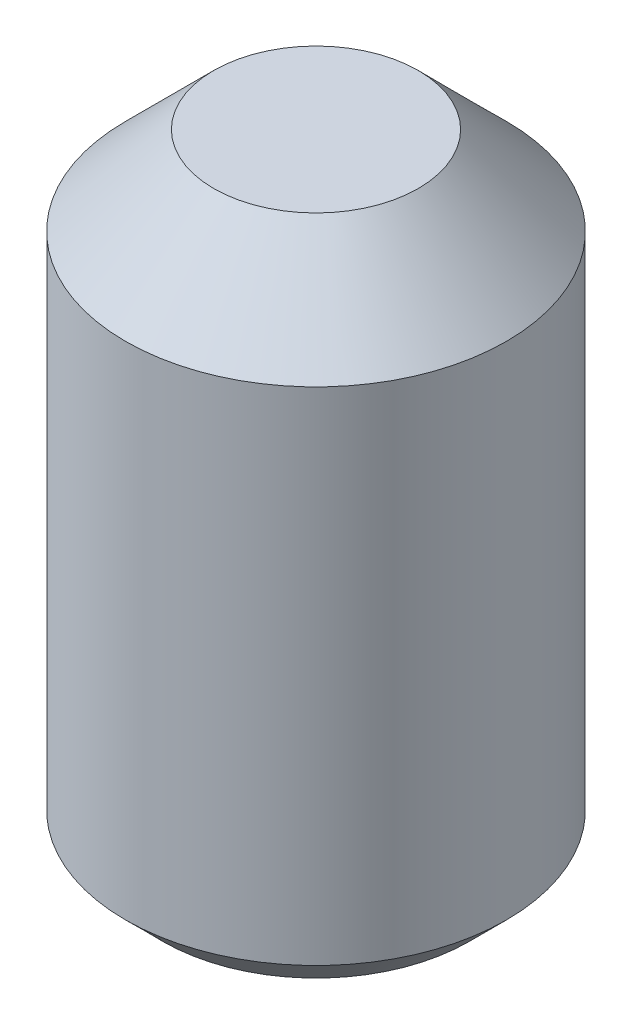
ISO-10303-21;
HEADER;
FILE_DESCRIPTION(('STEP AP214'),'2;1');
FILE_NAME('part.step','',(''),(''),'','','');
FILE_SCHEMA(('AUTOMOTIVE_DESIGN { 1 0 10303 214 1 1 1 1 }'));
ENDSEC;
DATA;
#1=APPLICATION_CONTEXT('core data for automotive mechanical design processes');
#2=APPLICATION_PROTOCOL_DEFINITION('international standard','automotive_design',2000,#1);
#3=PRODUCT_CONTEXT('',#1,'mechanical');
#4=PRODUCT('Part','Part','',(#3));
#5=PRODUCT_RELATED_PRODUCT_CATEGORY('part','',(#4));
#6=PRODUCT_DEFINITION_FORMATION('','',#4);
#7=PRODUCT_DEFINITION_CONTEXT('part definition',#1,'design');
#8=PRODUCT_DEFINITION('design','',#6,#7);
#9=PRODUCT_DEFINITION_SHAPE('','',#8);
#10=(LENGTH_UNIT() NAMED_UNIT(*) SI_UNIT(.MILLI.,.METRE.));
#11=(NAMED_UNIT(*) PLANE_ANGLE_UNIT() SI_UNIT($,.RADIAN.));
#12=(NAMED_UNIT(*) SI_UNIT($,.STERADIAN.) SOLID_ANGLE_UNIT());
#13=UNCERTAINTY_MEASURE_WITH_UNIT(LENGTH_MEASURE(1.E-05),#10,'distance_accuracy_value','');
#14=(GEOMETRIC_REPRESENTATION_CONTEXT(3) GLOBAL_UNCERTAINTY_ASSIGNED_CONTEXT((#13)) GLOBAL_UNIT_ASSIGNED_CONTEXT((#10,
#11,#12)) REPRESENTATION_CONTEXT('',''));
#15=CARTESIAN_POINT('',(0.,0.,0.));
#16=DIRECTION('',(0.,0.,1.));
#17=DIRECTION('',(1.,0.,0.));
#18=AXIS2_PLACEMENT_3D('',#15,#16,#17);
#19=CARTESIAN_POINT('',(0.,0.,0.));
#20=DIRECTION('',(0.,1.,0.));
#21=DIRECTION('',(-1.,0.,0.));
#22=AXIS2_PLACEMENT_3D('',#19,#20,#21);
#23=CYLINDRICAL_SURFACE('',#22,2.413);
#24=CARTESIAN_POINT('',(0.,0.472439999953159,0.));
#25=DIRECTION('',(0.,-1.,0.));
#26=DIRECTION('',(1.,0.,0.));
#27=AXIS2_PLACEMENT_3D('',#24,#25,#26);
#28=CIRCLE('',#27,2.413);
#29=CARTESIAN_POINT('',(2.413,0.472439999953159,0.));
#30=VERTEX_POINT('',#29);
#31=EDGE_CURVE('E40',#30,#30,#28,.F.);
#32=ORIENTED_EDGE('',*,*,#31,.T.);
#33=EDGE_LOOP('',(#32));
#34=FACE_BOUND('',#33,.T.);
#35=CARTESIAN_POINT('',(0.,6.8199,0.));
#36=DIRECTION('',(0.,1.,0.));
#37=DIRECTION('',(-1.,0.,0.));
#38=AXIS2_PLACEMENT_3D('',#35,#36,#37);
#39=CIRCLE('',#38,2.413);
#40=CARTESIAN_POINT('',(-2.413,6.8199,0.));
#41=VERTEX_POINT('',#40);
#42=EDGE_CURVE('E134',#41,#41,#39,.T.);
#43=ORIENTED_EDGE('',*,*,#42,.F.);
#44=EDGE_LOOP('',(#43));
#45=FACE_BOUND('',#44,.T.);
#46=ADVANCED_FACE('F32',(#34,#45),#23,.T.);
#47=CARTESIAN_POINT('',(2.413,0.,0.));
#48=DIRECTION('',(0.,-1.,0.));
#49=DIRECTION('',(1.,0.,0.));
#50=AXIS2_PLACEMENT_3D('',#47,#48,#49);
#51=PLANE('',#50);
#52=CARTESIAN_POINT('',(0.,0.,0.));
#53=DIRECTION('',(0.,-1.,0.));
#54=DIRECTION('',(1.,0.,0.));
#55=AXIS2_PLACEMENT_3D('',#52,#53,#54);
#56=CIRCLE('',#55,1.94056000004684);
#57=CARTESIAN_POINT('',(1.94056000004684,0.,0.));
#58=VERTEX_POINT('',#57);
#59=EDGE_CURVE('E11',#58,#58,#56,.T.);
#60=ORIENTED_EDGE('',*,*,#59,.T.);
#61=EDGE_LOOP('',(#60));
#62=FACE_BOUND('',#61,.T.);
#63=DIRECTION('',(-1.,0.,0.));
#64=VECTOR('',#63,1.);
#65=CARTESIAN_POINT('',(0.687040789999955,0.,1.18998955515204));
#66=LINE('',#65,#64);
#67=CARTESIAN_POINT('',(0.687040789999955,0.,1.18998955515204));
#68=VERTEX_POINT('',#67);
#69=CARTESIAN_POINT('',(-0.687040790000067,0.,1.18998955515204));
#70=VERTEX_POINT('',#69);
#71=EDGE_CURVE('E47',#68,#70,#66,.T.);
#72=ORIENTED_EDGE('',*,*,#71,.F.);
#73=DIRECTION('',(-0.5,0.,0.866025403784439));
#74=VECTOR('',#73,1.);
#75=CARTESIAN_POINT('',(1.37408157999982,0.,0.));
#76=LINE('',#75,#74);
#77=CARTESIAN_POINT('',(1.37408157999982,0.,0.));
#78=VERTEX_POINT('',#77);
#79=EDGE_CURVE('E130',#78,#68,#76,.T.);
#80=ORIENTED_EDGE('',*,*,#79,.F.);
#81=DIRECTION('',(0.5,0.,0.866025403784439));
#82=VECTOR('',#81,1.);
#83=CARTESIAN_POINT('',(0.687040789999932,0.,-1.18998955515205));
#84=LINE('',#83,#82);
#85=CARTESIAN_POINT('',(0.687040789999932,0.,-1.18998955515205));
#86=VERTEX_POINT('',#85);
#87=EDGE_CURVE('E128',#86,#78,#84,.T.);
#88=ORIENTED_EDGE('',*,*,#87,.F.);
#89=DIRECTION('',(1.,0.,0.));
#90=VECTOR('',#89,1.);
#91=CARTESIAN_POINT('',(-0.68704079000009,0.,-1.18998955515205));
#92=LINE('',#91,#90);
#93=CARTESIAN_POINT('',(-0.68704079000009,0.,-1.18998955515205));
#94=VERTEX_POINT('',#93);
#95=EDGE_CURVE('E95',#94,#86,#92,.T.);
#96=ORIENTED_EDGE('',*,*,#95,.F.);
#97=DIRECTION('',(0.5,0.,-0.866025403784439));
#98=VECTOR('',#97,1.);
#99=CARTESIAN_POINT('',(-1.37408157999996,0.,0.));
#100=LINE('',#99,#98);
#101=CARTESIAN_POINT('',(-1.37408157999996,0.,0.));
#102=VERTEX_POINT('',#101);
#103=EDGE_CURVE('E124',#102,#94,#100,.T.);
#104=ORIENTED_EDGE('',*,*,#103,.F.);
#105=DIRECTION('',(-0.5,0.,-0.866025403784439));
#106=VECTOR('',#105,1.);
#107=CARTESIAN_POINT('',(-0.687040790000068,0.,1.18998955515204));
#108=LINE('',#107,#106);
#109=EDGE_CURVE('E121',#70,#102,#108,.T.);
#110=ORIENTED_EDGE('',*,*,#109,.F.);
#111=EDGE_LOOP('',(#72,#80,#88,#96,#104,#110));
#112=FACE_BOUND('',#111,.T.);
#113=ADVANCED_FACE('F158',(#62,#112),#51,.T.);
#114=CARTESIAN_POINT('',(0.,7.93749999998251,0.));
#115=DIRECTION('',(0.,1.,0.));
#116=DIRECTION('',(-1.,0.,0.));
#117=AXIS2_PLACEMENT_3D('',#114,#115,#116);
#118=PLANE('',#117);
#119=CARTESIAN_POINT('',(0.,7.93749999998251,0.));
#120=DIRECTION('',(0.,1.,0.));
#121=DIRECTION('',(-1.,0.,0.));
#122=AXIS2_PLACEMENT_3D('',#119,#120,#121);
#123=CIRCLE('',#122,1.29540000001749);
#124=CARTESIAN_POINT('',(-1.29540000001749,7.93749999998251,0.));
#125=VERTEX_POINT('',#124);
#126=EDGE_CURVE('E142',#125,#125,#123,.T.);
#127=ORIENTED_EDGE('',*,*,#126,.T.);
#128=EDGE_LOOP('',(#127));
#129=FACE_BOUND('',#128,.T.);
#130=ADVANCED_FACE('F162',(#129),#118,.T.);
#131=CARTESIAN_POINT('',(0.,7.93749999998251,0.));
#132=DIRECTION('',(0.,-1.,0.));
#133=DIRECTION('',(1.,0.,0.));
#134=AXIS2_PLACEMENT_3D('',#131,#132,#133);
#135=CONICAL_SURFACE('',#134,1.29540000001749,0.785398163397448);
#136=ORIENTED_EDGE('',*,*,#42,.T.);
#137=EDGE_LOOP('',(#136));
#138=FACE_BOUND('',#137,.T.);
#139=ORIENTED_EDGE('',*,*,#126,.F.);
#140=EDGE_LOOP('',(#139));
#141=FACE_BOUND('',#140,.T.);
#142=ADVANCED_FACE('F168',(#138,#141),#135,.T.);
#143=CARTESIAN_POINT('',(0.687040789999955,2.54,1.18998955515204));
#144=DIRECTION('',(0.,0.,1.));
#145=DIRECTION('',(1.,0.,0.));
#146=AXIS2_PLACEMENT_3D('',#143,#144,#145);
#147=PLANE('',#146);
#148=ORIENTED_EDGE('',*,*,#71,.T.);
#149=DIRECTION('',(0.,-1.,0.));
#150=VECTOR('',#149,1.);
#151=CARTESIAN_POINT('',(-0.687040790000068,2.54,1.18998955515204));
#152=LINE('',#151,#150);
#153=CARTESIAN_POINT('',(-0.687040790000068,2.54,1.18998955515204));
#154=VERTEX_POINT('',#153);
#155=EDGE_CURVE('E77',#154,#70,#152,.T.);
#156=ORIENTED_EDGE('',*,*,#155,.F.);
#157=DIRECTION('',(-1.,0.,0.));
#158=VECTOR('',#157,1.);
#159=CARTESIAN_POINT('',(0.687040789999955,2.54,1.18998955515204));
#160=LINE('',#159,#158);
#161=CARTESIAN_POINT('',(0.687040789999955,2.54,1.18998955515204));
#162=VERTEX_POINT('',#161);
#163=EDGE_CURVE('E132',#162,#154,#160,.T.);
#164=ORIENTED_EDGE('',*,*,#163,.F.);
#165=DIRECTION('',(0.,-1.,0.));
#166=VECTOR('',#165,1.);
#167=CARTESIAN_POINT('',(0.687040789999955,2.54,1.18998955515204));
#168=LINE('',#167,#166);
#169=EDGE_CURVE('E55',#162,#68,#168,.T.);
#170=ORIENTED_EDGE('',*,*,#169,.T.);
#171=EDGE_LOOP('',(#148,#156,#164,#170));
#172=FACE_BOUND('',#171,.T.);
#173=ADVANCED_FACE('F172',(#172),#147,.F.);
#174=CARTESIAN_POINT('',(1.37408157999982,2.54,0.));
#175=DIRECTION('',(0.866025403784439,0.,0.5));
#176=DIRECTION('',(0.5,0.,-0.866025403784439));
#177=AXIS2_PLACEMENT_3D('',#174,#175,#176);
#178=PLANE('',#177);
#179=ORIENTED_EDGE('',*,*,#79,.T.);
#180=ORIENTED_EDGE('',*,*,#169,.F.);
#181=DIRECTION('',(-0.5,0.,0.866025403784439));
#182=VECTOR('',#181,1.);
#183=CARTESIAN_POINT('',(1.37408157999982,2.54,0.));
#184=LINE('',#183,#182);
#185=CARTESIAN_POINT('',(1.37408157999982,2.54,0.));
#186=VERTEX_POINT('',#185);
#187=EDGE_CURVE('E107',#186,#162,#184,.T.);
#188=ORIENTED_EDGE('',*,*,#187,.F.);
#189=DIRECTION('',(0.,-1.,0.));
#190=VECTOR('',#189,1.);
#191=CARTESIAN_POINT('',(1.37408157999982,2.54,0.));
#192=LINE('',#191,#190);
#193=EDGE_CURVE('E99',#186,#78,#192,.T.);
#194=ORIENTED_EDGE('',*,*,#193,.T.);
#195=EDGE_LOOP('',(#179,#180,#188,#194));
#196=FACE_BOUND('',#195,.T.);
#197=ADVANCED_FACE('F176',(#196),#178,.F.);
#198=CARTESIAN_POINT('',(0.687040789999932,2.54,-1.18998955515205));
#199=DIRECTION('',(0.866025403784439,0.,-0.5));
#200=DIRECTION('',(-0.5,0.,-0.866025403784439));
#201=AXIS2_PLACEMENT_3D('',#198,#199,#200);
#202=PLANE('',#201);
#203=ORIENTED_EDGE('',*,*,#87,.T.);
#204=ORIENTED_EDGE('',*,*,#193,.F.);
#205=DIRECTION('',(0.5,0.,0.866025403784439));
#206=VECTOR('',#205,1.);
#207=CARTESIAN_POINT('',(0.687040789999932,2.54,-1.18998955515205));
#208=LINE('',#207,#206);
#209=CARTESIAN_POINT('',(0.687040789999932,2.54,-1.18998955515205));
#210=VERTEX_POINT('',#209);
#211=EDGE_CURVE('E103',#210,#186,#208,.T.);
#212=ORIENTED_EDGE('',*,*,#211,.F.);
#213=DIRECTION('',(0.,-1.,0.));
#214=VECTOR('',#213,1.);
#215=CARTESIAN_POINT('',(0.687040789999932,2.54,-1.18998955515205));
#216=LINE('',#215,#214);
#217=EDGE_CURVE('E88',#210,#86,#216,.T.);
#218=ORIENTED_EDGE('',*,*,#217,.T.);
#219=EDGE_LOOP('',(#203,#204,#212,#218));
#220=FACE_BOUND('',#219,.T.);
#221=ADVANCED_FACE('F104',(#220),#202,.F.);
#222=CARTESIAN_POINT('',(-0.68704079000009,2.54,-1.18998955515205));
#223=DIRECTION('',(0.,0.,-1.));
#224=DIRECTION('',(-1.,0.,0.));
#225=AXIS2_PLACEMENT_3D('',#222,#223,#224);
#226=PLANE('',#225);
#227=ORIENTED_EDGE('',*,*,#95,.T.);
#228=ORIENTED_EDGE('',*,*,#217,.F.);
#229=DIRECTION('',(1.,0.,0.));
#230=VECTOR('',#229,1.);
#231=CARTESIAN_POINT('',(-0.68704079000009,2.54,-1.18998955515205));
#232=LINE('',#231,#230);
#233=CARTESIAN_POINT('',(-0.68704079000009,2.54,-1.18998955515205));
#234=VERTEX_POINT('',#233);
#235=EDGE_CURVE('E92',#234,#210,#232,.T.);
#236=ORIENTED_EDGE('',*,*,#235,.F.);
#237=DIRECTION('',(0.,-1.,0.));
#238=VECTOR('',#237,1.);
#239=CARTESIAN_POINT('',(-0.68704079000009,2.54,-1.18998955515205));
#240=LINE('',#239,#238);
#241=EDGE_CURVE('E100',#234,#94,#240,.T.);
#242=ORIENTED_EDGE('',*,*,#241,.T.);
#243=EDGE_LOOP('',(#227,#228,#236,#242));
#244=FACE_BOUND('',#243,.T.);
#245=ADVANCED_FACE('F90',(#244),#226,.F.);
#246=CARTESIAN_POINT('',(-1.37408157999996,2.54,0.));
#247=DIRECTION('',(-0.866025403784439,0.,-0.5));
#248=DIRECTION('',(-0.5,0.,0.866025403784439));
#249=AXIS2_PLACEMENT_3D('',#246,#247,#248);
#250=PLANE('',#249);
#251=ORIENTED_EDGE('',*,*,#103,.T.);
#252=ORIENTED_EDGE('',*,*,#241,.F.);
#253=DIRECTION('',(0.5,0.,-0.866025403784439));
#254=VECTOR('',#253,1.);
#255=CARTESIAN_POINT('',(-1.37408157999996,2.54,0.));
#256=LINE('',#255,#254);
#257=CARTESIAN_POINT('',(-1.37408157999996,2.54,0.));
#258=VERTEX_POINT('',#257);
#259=EDGE_CURVE('E113',#258,#234,#256,.T.);
#260=ORIENTED_EDGE('',*,*,#259,.F.);
#261=DIRECTION('',(0.,-1.,0.));
#262=VECTOR('',#261,1.);
#263=CARTESIAN_POINT('',(-1.37408157999996,2.54,0.));
#264=LINE('',#263,#262);
#265=EDGE_CURVE('E137',#258,#102,#264,.T.);
#266=ORIENTED_EDGE('',*,*,#265,.T.);
#267=EDGE_LOOP('',(#251,#252,#260,#266));
#268=FACE_BOUND('',#267,.T.);
#269=ADVANCED_FACE('F179',(#268),#250,.F.);
#270=CARTESIAN_POINT('',(-0.687040790000068,2.54,1.18998955515204));
#271=DIRECTION('',(-0.866025403784439,0.,0.5));
#272=DIRECTION('',(0.5,0.,0.866025403784439));
#273=AXIS2_PLACEMENT_3D('',#270,#271,#272);
#274=PLANE('',#273);
#275=ORIENTED_EDGE('',*,*,#109,.T.);
#276=ORIENTED_EDGE('',*,*,#265,.F.);
#277=DIRECTION('',(-0.5,0.,-0.866025403784439));
#278=VECTOR('',#277,1.);
#279=CARTESIAN_POINT('',(-0.687040790000068,2.54,1.18998955515204));
#280=LINE('',#279,#278);
#281=EDGE_CURVE('E115',#154,#258,#280,.T.);
#282=ORIENTED_EDGE('',*,*,#281,.F.);
#283=ORIENTED_EDGE('',*,*,#155,.T.);
#284=EDGE_LOOP('',(#275,#276,#282,#283));
#285=FACE_BOUND('',#284,.T.);
#286=ADVANCED_FACE('F154',(#285),#274,.F.);
#287=CARTESIAN_POINT('',(0.,2.54,0.));
#288=DIRECTION('',(0.,-1.,0.));
#289=DIRECTION('',(0.,0.,-1.));
#290=AXIS2_PLACEMENT_3D('',#287,#288,#289);
#291=PLANE('',#290);
#292=ORIENTED_EDGE('',*,*,#163,.T.);
#293=ORIENTED_EDGE('',*,*,#281,.T.);
#294=ORIENTED_EDGE('',*,*,#259,.T.);
#295=ORIENTED_EDGE('',*,*,#235,.T.);
#296=ORIENTED_EDGE('',*,*,#211,.T.);
#297=ORIENTED_EDGE('',*,*,#187,.T.);
#298=EDGE_LOOP('',(#292,#293,#294,#295,#296,#297));
#299=FACE_BOUND('',#298,.T.);
#300=ADVANCED_FACE('F110',(#299),#291,.T.);
#301=CARTESIAN_POINT('',(0.,0.472439999953159,0.));
#302=DIRECTION('',(0.,1.,0.));
#303=DIRECTION('',(-1.,0.,0.));
#304=AXIS2_PLACEMENT_3D('',#301,#302,#303);
#305=CONICAL_SURFACE('',#304,2.413,0.785398163397451);
#306=ORIENTED_EDGE('',*,*,#59,.F.);
#307=EDGE_LOOP('',(#306));
#308=FACE_BOUND('',#307,.T.);
#309=ORIENTED_EDGE('',*,*,#31,.F.);
#310=EDGE_LOOP('',(#309));
#311=FACE_BOUND('',#310,.T.);
#312=ADVANCED_FACE('F34',(#308,#311),#305,.T.);
#313=CLOSED_SHELL('',(#46,#113,#130,#142,#173,#197,#221,#245,#269,#286,#300,#312));
#314=MANIFOLD_SOLID_BREP('B2',#313);
#315=ADVANCED_BREP_SHAPE_REPRESENTATION('',(#18,#314),#14);
#316=SHAPE_DEFINITION_REPRESENTATION(#9,#315);
ENDSEC;
END-ISO-10303-21;
